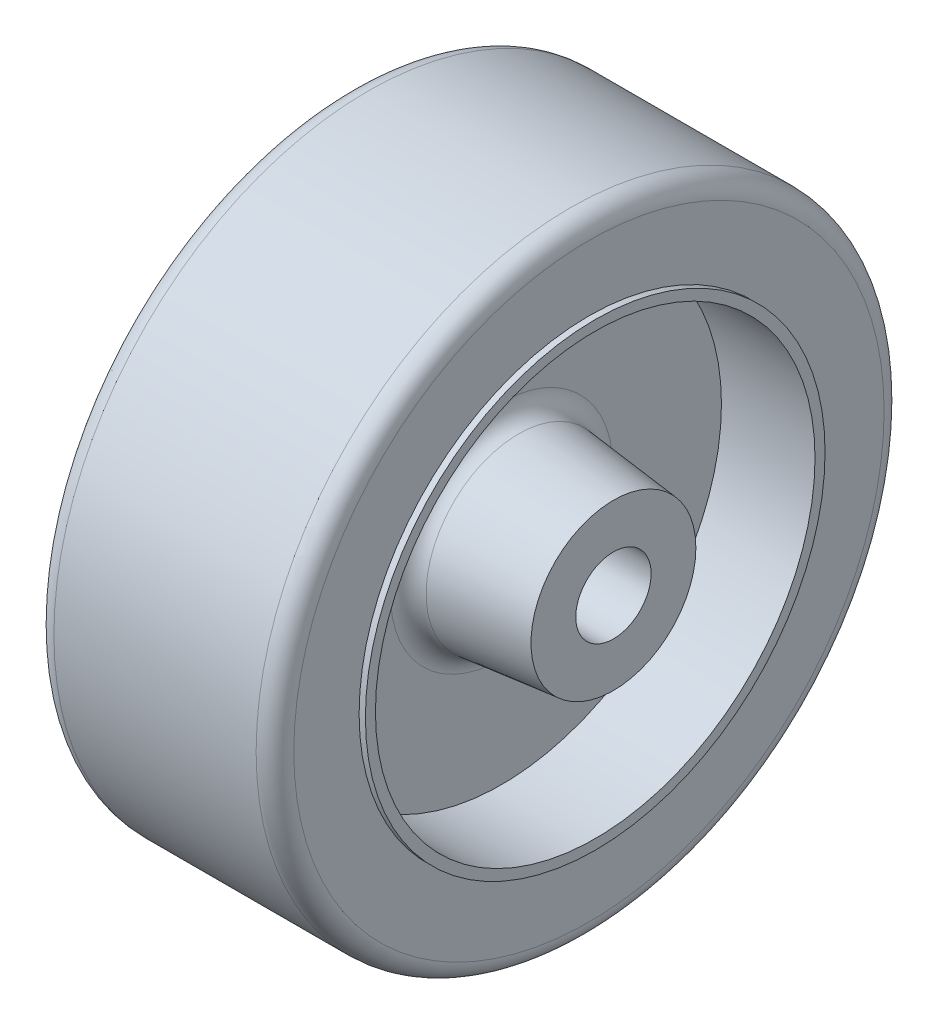
ISO-10303-21;
HEADER;
FILE_DESCRIPTION(('STEP AP214'),'2;1');
FILE_NAME('part.step','',(''),(''),'','','');
FILE_SCHEMA(('AUTOMOTIVE_DESIGN { 1 0 10303 214 1 1 1 1 }'));
ENDSEC;
DATA;
#1=APPLICATION_CONTEXT('core data for automotive mechanical design processes');
#2=APPLICATION_PROTOCOL_DEFINITION('international standard','automotive_design',2000,#1);
#3=PRODUCT_CONTEXT('',#1,'mechanical');
#4=PRODUCT('Part','Part','',(#3));
#5=PRODUCT_RELATED_PRODUCT_CATEGORY('part','',(#4));
#6=PRODUCT_DEFINITION_FORMATION('','',#4);
#7=PRODUCT_DEFINITION_CONTEXT('part definition',#1,'design');
#8=PRODUCT_DEFINITION('design','',#6,#7);
#9=PRODUCT_DEFINITION_SHAPE('','',#8);
#10=(LENGTH_UNIT() NAMED_UNIT(*) SI_UNIT(.MILLI.,.METRE.));
#11=(NAMED_UNIT(*) PLANE_ANGLE_UNIT() SI_UNIT($,.RADIAN.));
#12=(NAMED_UNIT(*) SI_UNIT($,.STERADIAN.) SOLID_ANGLE_UNIT());
#13=UNCERTAINTY_MEASURE_WITH_UNIT(LENGTH_MEASURE(1.E-05),#10,'distance_accuracy_value','');
#14=(GEOMETRIC_REPRESENTATION_CONTEXT(3) GLOBAL_UNCERTAINTY_ASSIGNED_CONTEXT((#13)) GLOBAL_UNIT_ASSIGNED_CONTEXT((#10,
#11,#12)) REPRESENTATION_CONTEXT('',''));
#15=CARTESIAN_POINT('',(0.,0.,0.));
#16=DIRECTION('',(0.,0.,1.));
#17=DIRECTION('',(1.,0.,0.));
#18=AXIS2_PLACEMENT_3D('',#15,#16,#17);
#19=CARTESIAN_POINT('',(19.1,0.,0.));
#20=DIRECTION('',(-1.,0.,0.));
#21=DIRECTION('',(0.,0.,1.));
#22=AXIS2_PLACEMENT_3D('',#19,#20,#21);
#23=CYLINDRICAL_SURFACE('',#22,25.);
#24=CARTESIAN_POINT('',(1.5,0.,0.));
#25=DIRECTION('',(1.,0.,0.));
#26=DIRECTION('',(0.,0.,-1.));
#27=AXIS2_PLACEMENT_3D('',#24,#25,#26);
#28=CIRCLE('',#27,25.);
#29=CARTESIAN_POINT('',(1.5,0.,-25.));
#30=VERTEX_POINT('',#29);
#31=EDGE_CURVE('E75',#30,#30,#28,.T.);
#32=ORIENTED_EDGE('',*,*,#31,.T.);
#33=EDGE_LOOP('',(#32));
#34=FACE_BOUND('',#33,.T.);
#35=CARTESIAN_POINT('',(17.6,0.,0.));
#36=DIRECTION('',(1.,0.,0.));
#37=DIRECTION('',(0.,0.,-1.));
#38=AXIS2_PLACEMENT_3D('',#35,#36,#37);
#39=CIRCLE('',#38,25.);
#40=CARTESIAN_POINT('',(17.6,0.,-25.));
#41=VERTEX_POINT('',#40);
#42=EDGE_CURVE('E79',#41,#41,#39,.F.);
#43=ORIENTED_EDGE('',*,*,#42,.T.);
#44=EDGE_LOOP('',(#43));
#45=FACE_BOUND('',#44,.T.);
#46=ADVANCED_FACE('F39',(#34,#45),#23,.T.);
#47=CARTESIAN_POINT('',(19.1,0.,0.));
#48=DIRECTION('',(1.,0.,0.));
#49=DIRECTION('',(0.,0.,-1.));
#50=AXIS2_PLACEMENT_3D('',#47,#48,#49);
#51=PLANE('',#50);
#52=CARTESIAN_POINT('',(19.1,0.,0.));
#53=DIRECTION('',(1.,0.,0.));
#54=DIRECTION('',(0.,0.,-1.));
#55=AXIS2_PLACEMENT_3D('',#52,#53,#54);
#56=CIRCLE('',#55,23.5);
#57=CARTESIAN_POINT('',(19.1,0.,-23.5));
#58=VERTEX_POINT('',#57);
#59=EDGE_CURVE('E67',#58,#58,#56,.T.);
#60=ORIENTED_EDGE('',*,*,#59,.T.);
#61=EDGE_LOOP('',(#60));
#62=FACE_BOUND('',#61,.T.);
#63=CARTESIAN_POINT('',(19.1,0.,0.));
#64=DIRECTION('',(1.,0.,0.));
#65=DIRECTION('',(0.,0.,-1.));
#66=AXIS2_PLACEMENT_3D('',#63,#64,#65);
#67=CIRCLE('',#66,18.3);
#68=CARTESIAN_POINT('',(19.1,0.,-18.3));
#69=VERTEX_POINT('',#68);
#70=EDGE_CURVE('E83',#69,#69,#67,.T.);
#71=ORIENTED_EDGE('',*,*,#70,.F.);
#72=EDGE_LOOP('',(#71));
#73=FACE_BOUND('',#72,.T.);
#74=ADVANCED_FACE('F147',(#62,#73),#51,.T.);
#75=CARTESIAN_POINT('',(0.,0.,0.));
#76=DIRECTION('',(1.,0.,0.));
#77=DIRECTION('',(0.,0.,-1.));
#78=AXIS2_PLACEMENT_3D('',#75,#76,#77);
#79=PLANE('',#78);
#80=CARTESIAN_POINT('',(0.,0.,0.));
#81=DIRECTION('',(1.,0.,0.));
#82=DIRECTION('',(0.,0.,-1.));
#83=AXIS2_PLACEMENT_3D('',#80,#81,#82);
#84=CIRCLE('',#83,18.3);
#85=CARTESIAN_POINT('',(0.,0.,-18.3));
#86=VERTEX_POINT('',#85);
#87=EDGE_CURVE('E63',#86,#86,#84,.F.);
#88=ORIENTED_EDGE('',*,*,#87,.F.);
#89=EDGE_LOOP('',(#88));
#90=FACE_BOUND('',#89,.T.);
#91=CARTESIAN_POINT('',(0.,0.,0.));
#92=DIRECTION('',(1.,0.,0.));
#93=DIRECTION('',(0.,0.,-1.));
#94=AXIS2_PLACEMENT_3D('',#91,#92,#93);
#95=CIRCLE('',#94,23.5);
#96=CARTESIAN_POINT('',(0.,0.,-23.5));
#97=VERTEX_POINT('',#96);
#98=EDGE_CURVE('E71',#97,#97,#95,.F.);
#99=ORIENTED_EDGE('',*,*,#98,.T.);
#100=EDGE_LOOP('',(#99));
#101=FACE_BOUND('',#100,.T.);
#102=ADVANCED_FACE('F153',(#90,#101),#79,.F.);
#103=CARTESIAN_POINT('',(19.6,0.,0.));
#104=DIRECTION('',(-1.,0.,0.));
#105=DIRECTION('',(0.,0.,1.));
#106=AXIS2_PLACEMENT_3D('',#103,#104,#105);
#107=CYLINDRICAL_SURFACE('',#106,18.3);
#108=CARTESIAN_POINT('',(19.6,0.,0.));
#109=DIRECTION('',(1.,0.,0.));
#110=DIRECTION('',(0.,0.,-1.));
#111=AXIS2_PLACEMENT_3D('',#108,#109,#110);
#112=CIRCLE('',#111,18.3);
#113=CARTESIAN_POINT('',(19.6,0.,-18.3));
#114=VERTEX_POINT('',#113);
#115=EDGE_CURVE('E87',#114,#114,#112,.T.);
#116=ORIENTED_EDGE('',*,*,#115,.F.);
#117=EDGE_LOOP('',(#116));
#118=FACE_BOUND('',#117,.T.);
#119=ORIENTED_EDGE('',*,*,#70,.T.);
#120=EDGE_LOOP('',(#119));
#121=FACE_BOUND('',#120,.T.);
#122=ADVANCED_FACE('F180',(#118,#121),#107,.T.);
#123=CARTESIAN_POINT('',(19.6,0.,0.));
#124=DIRECTION('',(1.,0.,0.));
#125=DIRECTION('',(0.,0.,-1.));
#126=AXIS2_PLACEMENT_3D('',#123,#124,#125);
#127=PLANE('',#126);
#128=CARTESIAN_POINT('',(19.6,0.,0.));
#129=DIRECTION('',(1.,0.,0.));
#130=DIRECTION('',(0.,0.,-1.));
#131=AXIS2_PLACEMENT_3D('',#128,#129,#130);
#132=CIRCLE('',#131,17.5);
#133=CARTESIAN_POINT('',(19.6,0.,-17.5));
#134=VERTEX_POINT('',#133);
#135=EDGE_CURVE('E104',#134,#134,#132,.T.);
#136=ORIENTED_EDGE('',*,*,#135,.F.);
#137=EDGE_LOOP('',(#136));
#138=FACE_BOUND('',#137,.T.);
#139=ORIENTED_EDGE('',*,*,#115,.T.);
#140=EDGE_LOOP('',(#139));
#141=FACE_BOUND('',#140,.T.);
#142=ADVANCED_FACE('F163',(#138,#141),#127,.T.);
#143=CARTESIAN_POINT('',(1.5,0.,0.));
#144=DIRECTION('',(1.,0.,0.));
#145=DIRECTION('',(0.,0.,-1.));
#146=AXIS2_PLACEMENT_3D('',#143,#144,#145);
#147=TOROIDAL_SURFACE('',#146,23.5,1.5);
#148=ORIENTED_EDGE('',*,*,#98,.F.);
#149=EDGE_LOOP('',(#148));
#150=FACE_BOUND('',#149,.T.);
#151=ORIENTED_EDGE('',*,*,#31,.F.);
#152=EDGE_LOOP('',(#151));
#153=FACE_BOUND('',#152,.T.);
#154=ADVANCED_FACE('F159',(#150,#153),#147,.T.);
#155=CARTESIAN_POINT('',(17.6,0.,0.));
#156=DIRECTION('',(1.,0.,0.));
#157=DIRECTION('',(0.,0.,-1.));
#158=AXIS2_PLACEMENT_3D('',#155,#156,#157);
#159=TOROIDAL_SURFACE('',#158,23.5,1.5);
#160=ORIENTED_EDGE('',*,*,#42,.F.);
#161=EDGE_LOOP('',(#160));
#162=FACE_BOUND('',#161,.T.);
#163=ORIENTED_EDGE('',*,*,#59,.F.);
#164=EDGE_LOOP('',(#163));
#165=FACE_BOUND('',#164,.T.);
#166=ADVANCED_FACE('F162',(#162,#165),#159,.T.);
#167=CARTESIAN_POINT('',(-0.5,0.,0.));
#168=DIRECTION('',(1.,0.,0.));
#169=DIRECTION('',(0.,0.,-1.));
#170=AXIS2_PLACEMENT_3D('',#167,#168,#169);
#171=CYLINDRICAL_SURFACE('',#170,18.3);
#172=CARTESIAN_POINT('',(-0.5,0.,0.));
#173=DIRECTION('',(-1.,0.,0.));
#174=DIRECTION('',(0.,0.,1.));
#175=AXIS2_PLACEMENT_3D('',#172,#173,#174);
#176=CIRCLE('',#175,18.3);
#177=CARTESIAN_POINT('',(-0.5,0.,18.3));
#178=VERTEX_POINT('',#177);
#179=EDGE_CURVE('E91',#178,#178,#176,.T.);
#180=ORIENTED_EDGE('',*,*,#179,.F.);
#181=EDGE_LOOP('',(#180));
#182=FACE_BOUND('',#181,.T.);
#183=ORIENTED_EDGE('',*,*,#87,.T.);
#184=EDGE_LOOP('',(#183));
#185=FACE_BOUND('',#184,.T.);
#186=ADVANCED_FACE('F166',(#182,#185),#171,.T.);
#187=CARTESIAN_POINT('',(-0.5,0.,0.));
#188=DIRECTION('',(-1.,0.,0.));
#189=DIRECTION('',(0.,0.,1.));
#190=AXIS2_PLACEMENT_3D('',#187,#188,#189);
#191=PLANE('',#190);
#192=CARTESIAN_POINT('',(-0.5,0.,0.));
#193=DIRECTION('',(-1.,0.,0.));
#194=DIRECTION('',(0.,0.,1.));
#195=AXIS2_PLACEMENT_3D('',#192,#193,#194);
#196=CIRCLE('',#195,17.5);
#197=CARTESIAN_POINT('',(-0.5,0.,17.5));
#198=VERTEX_POINT('',#197);
#199=EDGE_CURVE('E96',#198,#198,#196,.T.);
#200=ORIENTED_EDGE('',*,*,#199,.F.);
#201=EDGE_LOOP('',(#200));
#202=FACE_BOUND('',#201,.T.);
#203=ORIENTED_EDGE('',*,*,#179,.T.);
#204=EDGE_LOOP('',(#203));
#205=FACE_BOUND('',#204,.T.);
#206=ADVANCED_FACE('F171',(#202,#205),#191,.T.);
#207=CARTESIAN_POINT('',(6.95,0.,0.));
#208=DIRECTION('',(-1.,0.,0.));
#209=DIRECTION('',(0.,0.,1.));
#210=AXIS2_PLACEMENT_3D('',#207,#208,#209);
#211=CYLINDRICAL_SURFACE('',#210,17.5);
#212=CARTESIAN_POINT('',(6.95,0.,0.));
#213=DIRECTION('',(-1.,0.,0.));
#214=DIRECTION('',(0.,0.,1.));
#215=AXIS2_PLACEMENT_3D('',#212,#213,#214);
#216=CIRCLE('',#215,17.5);
#217=CARTESIAN_POINT('',(6.95,0.,17.5));
#218=VERTEX_POINT('',#217);
#219=EDGE_CURVE('E95',#218,#218,#216,.T.);
#220=ORIENTED_EDGE('',*,*,#219,.F.);
#221=EDGE_LOOP('',(#220));
#222=FACE_BOUND('',#221,.T.);
#223=ORIENTED_EDGE('',*,*,#199,.T.);
#224=EDGE_LOOP('',(#223));
#225=FACE_BOUND('',#224,.T.);
#226=ADVANCED_FACE('F195',(#222,#225),#211,.F.);
#227=CARTESIAN_POINT('',(6.95,0.,0.));
#228=DIRECTION('',(-1.,0.,0.));
#229=DIRECTION('',(0.,0.,1.));
#230=AXIS2_PLACEMENT_3D('',#227,#228,#229);
#231=PLANE('',#230);
#232=CARTESIAN_POINT('',(6.95,0.,0.));
#233=DIRECTION('',(-1.,0.,0.));
#234=DIRECTION('',(0.,0.,1.));
#235=AXIS2_PLACEMENT_3D('',#232,#233,#234);
#236=CIRCLE('',#235,8.85060606644676);
#237=CARTESIAN_POINT('',(6.95,0.,8.85060606644676));
#238=VERTEX_POINT('',#237);
#239=EDGE_CURVE('E10',#238,#238,#236,.F.);
#240=ORIENTED_EDGE('',*,*,#239,.T.);
#241=EDGE_LOOP('',(#240));
#242=FACE_BOUND('',#241,.T.);
#243=ORIENTED_EDGE('',*,*,#219,.T.);
#244=EDGE_LOOP('',(#243));
#245=FACE_BOUND('',#244,.T.);
#246=ADVANCED_FACE('F199',(#242,#245),#231,.T.);
#247=CARTESIAN_POINT('',(12.15,0.,0.));
#248=DIRECTION('',(1.,0.,0.));
#249=DIRECTION('',(0.,0.,-1.));
#250=AXIS2_PLACEMENT_3D('',#247,#248,#249);
#251=CYLINDRICAL_SURFACE('',#250,17.5);
#252=CARTESIAN_POINT('',(12.15,0.,0.));
#253=DIRECTION('',(1.,0.,0.));
#254=DIRECTION('',(0.,0.,-1.));
#255=AXIS2_PLACEMENT_3D('',#252,#253,#254);
#256=CIRCLE('',#255,17.5);
#257=CARTESIAN_POINT('',(12.15,0.,-17.5));
#258=VERTEX_POINT('',#257);
#259=EDGE_CURVE('E100',#258,#258,#256,.T.);
#260=ORIENTED_EDGE('',*,*,#259,.F.);
#261=EDGE_LOOP('',(#260));
#262=FACE_BOUND('',#261,.T.);
#263=ORIENTED_EDGE('',*,*,#135,.T.);
#264=EDGE_LOOP('',(#263));
#265=FACE_BOUND('',#264,.T.);
#266=ADVANCED_FACE('F203',(#262,#265),#251,.F.);
#267=CARTESIAN_POINT('',(12.15,0.,0.));
#268=DIRECTION('',(1.,0.,0.));
#269=DIRECTION('',(0.,0.,-1.));
#270=AXIS2_PLACEMENT_3D('',#267,#268,#269);
#271=PLANE('',#270);
#272=CARTESIAN_POINT('',(12.15,0.,0.));
#273=DIRECTION('',(1.,0.,0.));
#274=DIRECTION('',(0.,0.,-1.));
#275=AXIS2_PLACEMENT_3D('',#272,#273,#274);
#276=CIRCLE('',#275,8.85060606644676);
#277=CARTESIAN_POINT('',(12.15,0.,-8.85060606644676));
#278=VERTEX_POINT('',#277);
#279=EDGE_CURVE('E52',#278,#278,#276,.F.);
#280=ORIENTED_EDGE('',*,*,#279,.T.);
#281=EDGE_LOOP('',(#280));
#282=FACE_BOUND('',#281,.T.);
#283=ORIENTED_EDGE('',*,*,#259,.T.);
#284=EDGE_LOOP('',(#283));
#285=FACE_BOUND('',#284,.T.);
#286=ADVANCED_FACE('F206',(#282,#285),#271,.T.);
#287=CARTESIAN_POINT('',(12.15,0.,0.));
#288=DIRECTION('',(-1.,0.,0.));
#289=DIRECTION('',(0.,0.,-1.));
#290=AXIS2_PLACEMENT_3D('',#287,#288,#289);
#291=CONICAL_SURFACE('',#290,7.5,0.10471975511966);
#292=CARTESIAN_POINT('',(13.4932073050985,0.,0.));
#293=DIRECTION('',(1.,0.,0.));
#294=DIRECTION('',(0.,0.,-1.));
#295=AXIS2_PLACEMENT_3D('',#292,#293,#294);
#296=CIRCLE('',#295,7.35882322339435);
#297=CARTESIAN_POINT('',(13.4932073050985,0.,-7.35882322339435));
#298=VERTEX_POINT('',#297);
#299=EDGE_CURVE('E57',#298,#298,#296,.T.);
#300=ORIENTED_EDGE('',*,*,#299,.T.);
#301=EDGE_LOOP('',(#300));
#302=FACE_BOUND('',#301,.T.);
#303=CARTESIAN_POINT('',(21.05,0.,0.));
#304=DIRECTION('',(1.,0.,0.));
#305=DIRECTION('',(0.,0.,-1.));
#306=AXIS2_PLACEMENT_3D('',#303,#304,#305);
#307=CIRCLE('',#306,6.56457230613548);
#308=CARTESIAN_POINT('',(21.05,0.,-6.56457230613548));
#309=VERTEX_POINT('',#308);
#310=EDGE_CURVE('E108',#309,#309,#307,.T.);
#311=ORIENTED_EDGE('',*,*,#310,.F.);
#312=EDGE_LOOP('',(#311));
#313=FACE_BOUND('',#312,.T.);
#314=ADVANCED_FACE('F210',(#302,#313),#291,.T.);
#315=CARTESIAN_POINT('',(21.05,0.,0.));
#316=DIRECTION('',(1.,0.,0.));
#317=DIRECTION('',(0.,0.,-1.));
#318=AXIS2_PLACEMENT_3D('',#315,#316,#317);
#319=PLANE('',#318);
#320=CARTESIAN_POINT('',(21.05,0.,0.));
#321=DIRECTION('',(1.,0.,0.));
#322=DIRECTION('',(0.,0.,-1.));
#323=AXIS2_PLACEMENT_3D('',#320,#321,#322);
#324=CIRCLE('',#323,3.);
#325=CARTESIAN_POINT('',(21.05,0.,-3.));
#326=VERTEX_POINT('',#325);
#327=EDGE_CURVE('E119',#326,#326,#324,.T.);
#328=ORIENTED_EDGE('',*,*,#327,.F.);
#329=EDGE_LOOP('',(#328));
#330=FACE_BOUND('',#329,.T.);
#331=ORIENTED_EDGE('',*,*,#310,.T.);
#332=EDGE_LOOP('',(#331));
#333=FACE_BOUND('',#332,.T.);
#334=ADVANCED_FACE('F143',(#330,#333),#319,.T.);
#335=CARTESIAN_POINT('',(13.65,0.,0.));
#336=DIRECTION('',(1.,0.,0.));
#337=DIRECTION('',(0.,0.,-1.));
#338=AXIS2_PLACEMENT_3D('',#335,#336,#337);
#339=TOROIDAL_SURFACE('',#338,8.85060606644676,1.5);
#340=ORIENTED_EDGE('',*,*,#279,.F.);
#341=EDGE_LOOP('',(#340));
#342=FACE_BOUND('',#341,.T.);
#343=ORIENTED_EDGE('',*,*,#299,.F.);
#344=EDGE_LOOP('',(#343));
#345=FACE_BOUND('',#344,.T.);
#346=ADVANCED_FACE('F138',(#342,#345),#339,.F.);
#347=CARTESIAN_POINT('',(6.95,0.,0.));
#348=DIRECTION('',(1.,0.,0.));
#349=DIRECTION('',(0.,0.,1.));
#350=AXIS2_PLACEMENT_3D('',#347,#348,#349);
#351=CONICAL_SURFACE('',#350,7.5,0.10471975511966);
#352=CARTESIAN_POINT('',(5.60679269490148,0.,0.));
#353=DIRECTION('',(-1.,0.,0.));
#354=DIRECTION('',(0.,0.,1.));
#355=AXIS2_PLACEMENT_3D('',#352,#353,#354);
#356=CIRCLE('',#355,7.35882322339435);
#357=CARTESIAN_POINT('',(5.60679269490148,0.,7.35882322339435));
#358=VERTEX_POINT('',#357);
#359=EDGE_CURVE('E47',#358,#358,#356,.T.);
#360=ORIENTED_EDGE('',*,*,#359,.T.);
#361=EDGE_LOOP('',(#360));
#362=FACE_BOUND('',#361,.T.);
#363=CARTESIAN_POINT('',(-1.95,0.,0.));
#364=DIRECTION('',(-1.,0.,0.));
#365=DIRECTION('',(0.,0.,1.));
#366=AXIS2_PLACEMENT_3D('',#363,#364,#365);
#367=CIRCLE('',#366,6.56457230613548);
#368=CARTESIAN_POINT('',(-1.95,0.,6.56457230613548));
#369=VERTEX_POINT('',#368);
#370=EDGE_CURVE('E115',#369,#369,#367,.T.);
#371=ORIENTED_EDGE('',*,*,#370,.F.);
#372=EDGE_LOOP('',(#371));
#373=FACE_BOUND('',#372,.T.);
#374=ADVANCED_FACE('F133',(#362,#373),#351,.T.);
#375=CARTESIAN_POINT('',(-1.95,0.,0.));
#376=DIRECTION('',(-1.,0.,0.));
#377=DIRECTION('',(0.,0.,1.));
#378=AXIS2_PLACEMENT_3D('',#375,#376,#377);
#379=PLANE('',#378);
#380=CARTESIAN_POINT('',(-1.95,0.,0.));
#381=DIRECTION('',(-1.,0.,0.));
#382=DIRECTION('',(0.,0.,1.));
#383=AXIS2_PLACEMENT_3D('',#380,#381,#382);
#384=CIRCLE('',#383,3.);
#385=CARTESIAN_POINT('',(-1.95,0.,3.));
#386=VERTEX_POINT('',#385);
#387=EDGE_CURVE('E123',#386,#386,#384,.T.);
#388=ORIENTED_EDGE('',*,*,#387,.F.);
#389=EDGE_LOOP('',(#388));
#390=FACE_BOUND('',#389,.T.);
#391=ORIENTED_EDGE('',*,*,#370,.T.);
#392=EDGE_LOOP('',(#391));
#393=FACE_BOUND('',#392,.T.);
#394=ADVANCED_FACE('F130',(#390,#393),#379,.T.);
#395=CARTESIAN_POINT('',(5.45,0.,0.));
#396=DIRECTION('',(-1.,0.,0.));
#397=DIRECTION('',(0.,0.,1.));
#398=AXIS2_PLACEMENT_3D('',#395,#396,#397);
#399=TOROIDAL_SURFACE('',#398,8.85060606644676,1.5);
#400=ORIENTED_EDGE('',*,*,#239,.F.);
#401=EDGE_LOOP('',(#400));
#402=FACE_BOUND('',#401,.T.);
#403=ORIENTED_EDGE('',*,*,#359,.F.);
#404=EDGE_LOOP('',(#403));
#405=FACE_BOUND('',#404,.T.);
#406=ADVANCED_FACE('F41',(#402,#405),#399,.F.);
#407=CARTESIAN_POINT('',(26.95,0.,0.));
#408=DIRECTION('',(-1.,0.,0.));
#409=DIRECTION('',(0.,0.,1.));
#410=AXIS2_PLACEMENT_3D('',#407,#408,#409);
#411=CYLINDRICAL_SURFACE('',#410,3.);
#412=ORIENTED_EDGE('',*,*,#327,.T.);
#413=EDGE_LOOP('',(#412));
#414=FACE_BOUND('',#413,.T.);
#415=ORIENTED_EDGE('',*,*,#387,.T.);
#416=EDGE_LOOP('',(#415));
#417=FACE_BOUND('',#416,.T.);
#418=ADVANCED_FACE('F128',(#414,#417),#411,.F.);
#419=CLOSED_SHELL('',(#46,#74,#102,#122,#142,#154,#166,#186,#206,#226,#246,#266,#286,#314,#334,
#346,#374,#394,#406,#418));
#420=MANIFOLD_SOLID_BREP('B2',#419);
#421=ADVANCED_BREP_SHAPE_REPRESENTATION('',(#18,#420),#14);
#422=SHAPE_DEFINITION_REPRESENTATION(#9,#421);
ENDSEC;
END-ISO-10303-21;
